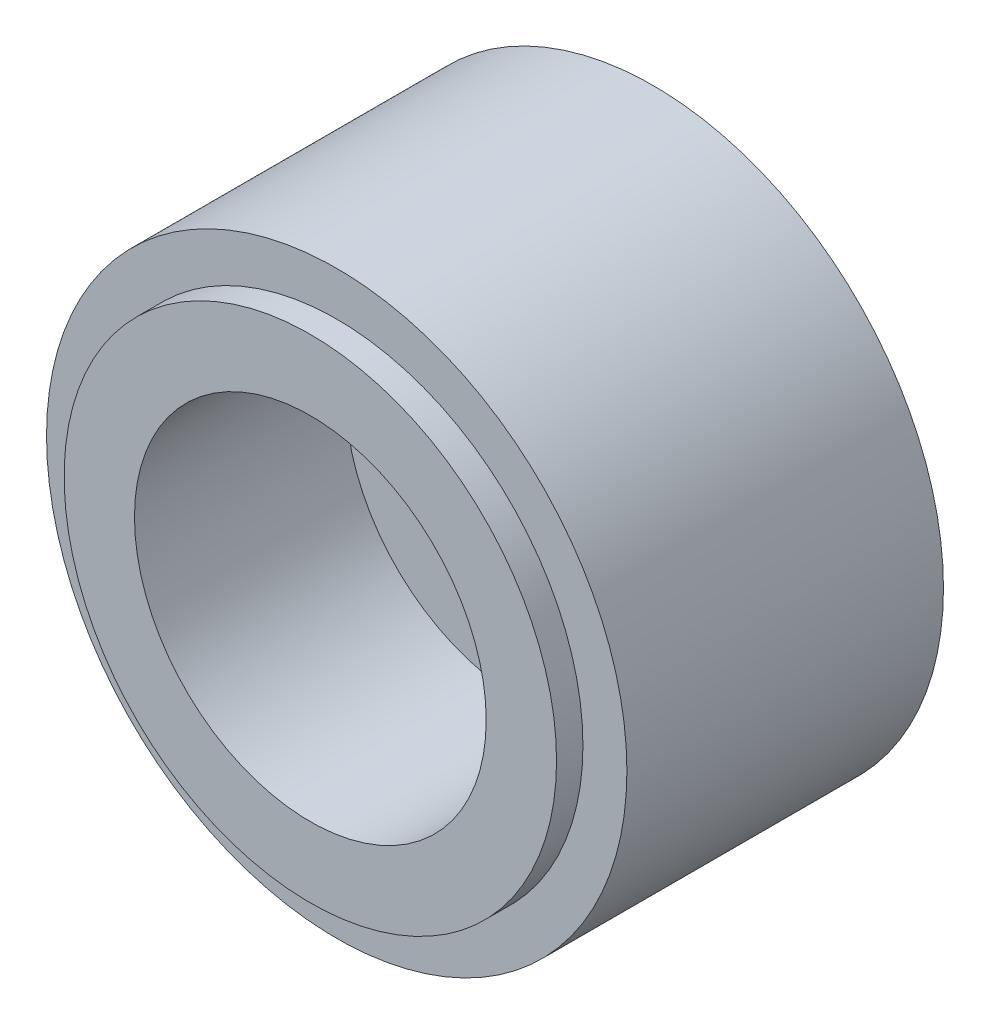
ISO-10303-21;
HEADER;
FILE_DESCRIPTION(('STEP AP214'),'2;1');
FILE_NAME('part.step','',(''),(''),'','','');
FILE_SCHEMA(('AUTOMOTIVE_DESIGN { 1 0 10303 214 1 1 1 1 }'));
ENDSEC;
DATA;
#1=APPLICATION_CONTEXT('core data for automotive mechanical design processes');
#2=APPLICATION_PROTOCOL_DEFINITION('international standard','automotive_design',2000,#1);
#3=PRODUCT_CONTEXT('',#1,'mechanical');
#4=PRODUCT('Part','Part','',(#3));
#5=PRODUCT_RELATED_PRODUCT_CATEGORY('part','',(#4));
#6=PRODUCT_DEFINITION_FORMATION('','',#4);
#7=PRODUCT_DEFINITION_CONTEXT('part definition',#1,'design');
#8=PRODUCT_DEFINITION('design','',#6,#7);
#9=PRODUCT_DEFINITION_SHAPE('','',#8);
#10=(LENGTH_UNIT() NAMED_UNIT(*) SI_UNIT(.MILLI.,.METRE.));
#11=(NAMED_UNIT(*) PLANE_ANGLE_UNIT() SI_UNIT($,.RADIAN.));
#12=(NAMED_UNIT(*) SI_UNIT($,.STERADIAN.) SOLID_ANGLE_UNIT());
#13=UNCERTAINTY_MEASURE_WITH_UNIT(LENGTH_MEASURE(1.E-05),#10,'distance_accuracy_value','');
#14=(GEOMETRIC_REPRESENTATION_CONTEXT(3) GLOBAL_UNCERTAINTY_ASSIGNED_CONTEXT((#13)) GLOBAL_UNIT_ASSIGNED_CONTEXT((#10,
#11,#12)) REPRESENTATION_CONTEXT('',''));
#15=CARTESIAN_POINT('',(0.,0.,0.));
#16=DIRECTION('',(0.,0.,1.));
#17=DIRECTION('',(1.,0.,0.));
#18=AXIS2_PLACEMENT_3D('',#15,#16,#17);
#19=CARTESIAN_POINT('',(0.,0.,1.5));
#20=DIRECTION('',(0.,0.,-1.));
#21=DIRECTION('',(-1.,0.,0.));
#22=AXIS2_PLACEMENT_3D('',#19,#20,#21);
#23=CYLINDRICAL_SURFACE('',#22,1.5);
#24=CARTESIAN_POINT('',(0.,0.,0.));
#25=DIRECTION('',(0.,0.,1.));
#26=DIRECTION('',(1.,0.,0.));
#27=AXIS2_PLACEMENT_3D('',#24,#25,#26);
#28=CIRCLE('',#27,1.5);
#29=CARTESIAN_POINT('',(1.5,0.,0.));
#30=VERTEX_POINT('',#29);
#31=EDGE_CURVE('E52',#30,#30,#28,.T.);
#32=ORIENTED_EDGE('',*,*,#31,.F.);
#33=EDGE_LOOP('',(#32));
#34=FACE_BOUND('',#33,.T.);
#35=CARTESIAN_POINT('',(0.,0.,9.));
#36=DIRECTION('',(0.,0.,1.));
#37=DIRECTION('',(1.,0.,0.));
#38=AXIS2_PLACEMENT_3D('',#35,#36,#37);
#39=CIRCLE('',#38,1.5);
#40=CARTESIAN_POINT('',(1.5,0.,9.));
#41=VERTEX_POINT('',#40);
#42=EDGE_CURVE('E41',#41,#41,#39,.T.);
#43=ORIENTED_EDGE('',*,*,#42,.T.);
#44=EDGE_LOOP('',(#43));
#45=FACE_BOUND('',#44,.T.);
#46=ADVANCED_FACE('F37',(#34,#45),#23,.F.);
#47=CARTESIAN_POINT('',(0.,0.,0.));
#48=DIRECTION('',(0.,0.,1.));
#49=DIRECTION('',(1.,0.,0.));
#50=AXIS2_PLACEMENT_3D('',#47,#48,#49);
#51=PLANE('',#50);
#52=CARTESIAN_POINT('',(0.,0.,0.));
#53=DIRECTION('',(0.,0.,1.));
#54=DIRECTION('',(1.,0.,0.));
#55=AXIS2_PLACEMENT_3D('',#52,#53,#54);
#56=CIRCLE('',#55,14.);
#57=CARTESIAN_POINT('',(14.,0.,0.));
#58=VERTEX_POINT('',#57);
#59=EDGE_CURVE('E46',#58,#58,#56,.T.);
#60=ORIENTED_EDGE('',*,*,#59,.F.);
#61=EDGE_LOOP('',(#60));
#62=FACE_BOUND('',#61,.T.);
#63=ORIENTED_EDGE('',*,*,#31,.T.);
#64=EDGE_LOOP('',(#63));
#65=FACE_BOUND('',#64,.T.);
#66=ADVANCED_FACE('F104',(#62,#65),#51,.F.);
#67=CARTESIAN_POINT('',(0.,0.,1.5));
#68=DIRECTION('',(0.,0.,-1.));
#69=DIRECTION('',(-1.,0.,0.));
#70=AXIS2_PLACEMENT_3D('',#67,#68,#69);
#71=CYLINDRICAL_SURFACE('',#70,14.);
#72=CARTESIAN_POINT('',(0.,0.,1.5));
#73=DIRECTION('',(0.,0.,1.));
#74=DIRECTION('',(1.,0.,0.));
#75=AXIS2_PLACEMENT_3D('',#72,#73,#74);
#76=CIRCLE('',#75,14.);
#77=CARTESIAN_POINT('',(14.,0.,1.5));
#78=VERTEX_POINT('',#77);
#79=EDGE_CURVE('E10',#78,#78,#76,.T.);
#80=ORIENTED_EDGE('',*,*,#79,.F.);
#81=EDGE_LOOP('',(#80));
#82=FACE_BOUND('',#81,.T.);
#83=ORIENTED_EDGE('',*,*,#59,.T.);
#84=EDGE_LOOP('',(#83));
#85=FACE_BOUND('',#84,.T.);
#86=ADVANCED_FACE('F39',(#82,#85),#71,.T.);
#87=CARTESIAN_POINT('',(0.,0.,21.));
#88=DIRECTION('',(0.,0.,1.));
#89=DIRECTION('',(1.,0.,0.));
#90=AXIS2_PLACEMENT_3D('',#87,#88,#89);
#91=PLANE('',#90);
#92=CARTESIAN_POINT('',(0.,0.,21.));
#93=DIRECTION('',(0.,0.,1.));
#94=DIRECTION('',(1.,0.,0.));
#95=AXIS2_PLACEMENT_3D('',#92,#93,#94);
#96=CIRCLE('',#95,10.);
#97=CARTESIAN_POINT('',(10.,0.,21.));
#98=VERTEX_POINT('',#97);
#99=EDGE_CURVE('E61',#98,#98,#96,.T.);
#100=ORIENTED_EDGE('',*,*,#99,.F.);
#101=EDGE_LOOP('',(#100));
#102=FACE_BOUND('',#101,.T.);
#103=CARTESIAN_POINT('',(0.,0.,21.));
#104=DIRECTION('',(0.,0.,1.));
#105=DIRECTION('',(1.,0.,0.));
#106=AXIS2_PLACEMENT_3D('',#103,#104,#105);
#107=CIRCLE('',#106,14.);
#108=CARTESIAN_POINT('',(14.,0.,21.));
#109=VERTEX_POINT('',#108);
#110=EDGE_CURVE('E57',#109,#109,#107,.T.);
#111=ORIENTED_EDGE('',*,*,#110,.T.);
#112=EDGE_LOOP('',(#111));
#113=FACE_BOUND('',#112,.T.);
#114=ADVANCED_FACE('F117',(#102,#113),#91,.T.);
#115=CARTESIAN_POINT('',(0.,0.,21.));
#116=DIRECTION('',(0.,0.,-1.));
#117=DIRECTION('',(-1.,0.,0.));
#118=AXIS2_PLACEMENT_3D('',#115,#116,#117);
#119=CYLINDRICAL_SURFACE('',#118,14.);
#120=ORIENTED_EDGE('',*,*,#110,.F.);
#121=EDGE_LOOP('',(#120));
#122=FACE_BOUND('',#121,.T.);
#123=CARTESIAN_POINT('',(0.,0.,19.5));
#124=DIRECTION('',(0.,0.,1.));
#125=DIRECTION('',(1.,0.,0.));
#126=AXIS2_PLACEMENT_3D('',#123,#124,#125);
#127=CIRCLE('',#126,14.);
#128=CARTESIAN_POINT('',(14.,0.,19.5));
#129=VERTEX_POINT('',#128);
#130=EDGE_CURVE('E66',#129,#129,#127,.T.);
#131=ORIENTED_EDGE('',*,*,#130,.T.);
#132=EDGE_LOOP('',(#131));
#133=FACE_BOUND('',#132,.T.);
#134=ADVANCED_FACE('F114',(#122,#133),#119,.T.);
#135=CARTESIAN_POINT('',(0.,0.,9.));
#136=DIRECTION('',(0.,0.,1.));
#137=DIRECTION('',(1.,0.,0.));
#138=AXIS2_PLACEMENT_3D('',#135,#136,#137);
#139=CYLINDRICAL_SURFACE('',#138,10.);
#140=CARTESIAN_POINT('',(0.,0.,9.));
#141=DIRECTION('',(0.,0.,1.));
#142=DIRECTION('',(1.,0.,0.));
#143=AXIS2_PLACEMENT_3D('',#140,#141,#142);
#144=CIRCLE('',#143,10.);
#145=CARTESIAN_POINT('',(10.,0.,9.));
#146=VERTEX_POINT('',#145);
#147=EDGE_CURVE('E65',#146,#146,#144,.T.);
#148=ORIENTED_EDGE('',*,*,#147,.F.);
#149=EDGE_LOOP('',(#148));
#150=FACE_BOUND('',#149,.T.);
#151=ORIENTED_EDGE('',*,*,#99,.T.);
#152=EDGE_LOOP('',(#151));
#153=FACE_BOUND('',#152,.T.);
#154=ADVANCED_FACE('F100',(#150,#153),#139,.F.);
#155=CARTESIAN_POINT('',(0.,0.,9.));
#156=DIRECTION('',(0.,0.,1.));
#157=DIRECTION('',(1.,0.,0.));
#158=AXIS2_PLACEMENT_3D('',#155,#156,#157);
#159=PLANE('',#158);
#160=ORIENTED_EDGE('',*,*,#42,.F.);
#161=EDGE_LOOP('',(#160));
#162=FACE_BOUND('',#161,.T.);
#163=ORIENTED_EDGE('',*,*,#147,.T.);
#164=EDGE_LOOP('',(#163));
#165=FACE_BOUND('',#164,.T.);
#166=ADVANCED_FACE('F92',(#162,#165),#159,.T.);
#167=CARTESIAN_POINT('',(0.,0.,1.5));
#168=DIRECTION('',(0.,0.,1.));
#169=DIRECTION('',(1.,0.,0.));
#170=AXIS2_PLACEMENT_3D('',#167,#168,#169);
#171=PLANE('',#170);
#172=CARTESIAN_POINT('',(0.,0.,1.5));
#173=DIRECTION('',(0.,0.,1.));
#174=DIRECTION('',(1.,0.,0.));
#175=AXIS2_PLACEMENT_3D('',#172,#173,#174);
#176=CIRCLE('',#175,16.5);
#177=CARTESIAN_POINT('',(16.5,0.,1.5));
#178=VERTEX_POINT('',#177);
#179=EDGE_CURVE('E74',#178,#178,#176,.T.);
#180=ORIENTED_EDGE('',*,*,#179,.F.);
#181=EDGE_LOOP('',(#180));
#182=FACE_BOUND('',#181,.T.);
#183=ORIENTED_EDGE('',*,*,#79,.T.);
#184=EDGE_LOOP('',(#183));
#185=FACE_BOUND('',#184,.T.);
#186=ADVANCED_FACE('F90',(#182,#185),#171,.F.);
#187=CARTESIAN_POINT('',(0.,0.,19.5));
#188=DIRECTION('',(0.,0.,1.));
#189=DIRECTION('',(1.,0.,0.));
#190=AXIS2_PLACEMENT_3D('',#187,#188,#189);
#191=PLANE('',#190);
#192=ORIENTED_EDGE('',*,*,#130,.F.);
#193=EDGE_LOOP('',(#192));
#194=FACE_BOUND('',#193,.T.);
#195=CARTESIAN_POINT('',(0.,0.,19.5));
#196=DIRECTION('',(0.,0.,1.));
#197=DIRECTION('',(1.,0.,0.));
#198=AXIS2_PLACEMENT_3D('',#195,#196,#197);
#199=CIRCLE('',#198,16.5);
#200=CARTESIAN_POINT('',(16.5,0.,19.5));
#201=VERTEX_POINT('',#200);
#202=EDGE_CURVE('E73',#201,#201,#199,.T.);
#203=ORIENTED_EDGE('',*,*,#202,.T.);
#204=EDGE_LOOP('',(#203));
#205=FACE_BOUND('',#204,.T.);
#206=ADVANCED_FACE('F82',(#194,#205),#191,.T.);
#207=CARTESIAN_POINT('',(0.,0.,19.5));
#208=DIRECTION('',(0.,0.,-1.));
#209=DIRECTION('',(-1.,0.,0.));
#210=AXIS2_PLACEMENT_3D('',#207,#208,#209);
#211=CYLINDRICAL_SURFACE('',#210,16.5);
#212=ORIENTED_EDGE('',*,*,#202,.F.);
#213=EDGE_LOOP('',(#212));
#214=FACE_BOUND('',#213,.T.);
#215=ORIENTED_EDGE('',*,*,#179,.T.);
#216=EDGE_LOOP('',(#215));
#217=FACE_BOUND('',#216,.T.);
#218=ADVANCED_FACE('F84',(#214,#217),#211,.T.);
#219=CLOSED_SHELL('',(#46,#66,#86,#114,#134,#154,#166,#186,#206,#218));
#220=MANIFOLD_SOLID_BREP('B2',#219);
#221=ADVANCED_BREP_SHAPE_REPRESENTATION('',(#18,#220),#14);
#222=SHAPE_DEFINITION_REPRESENTATION(#9,#221);
ENDSEC;
END-ISO-10303-21;
